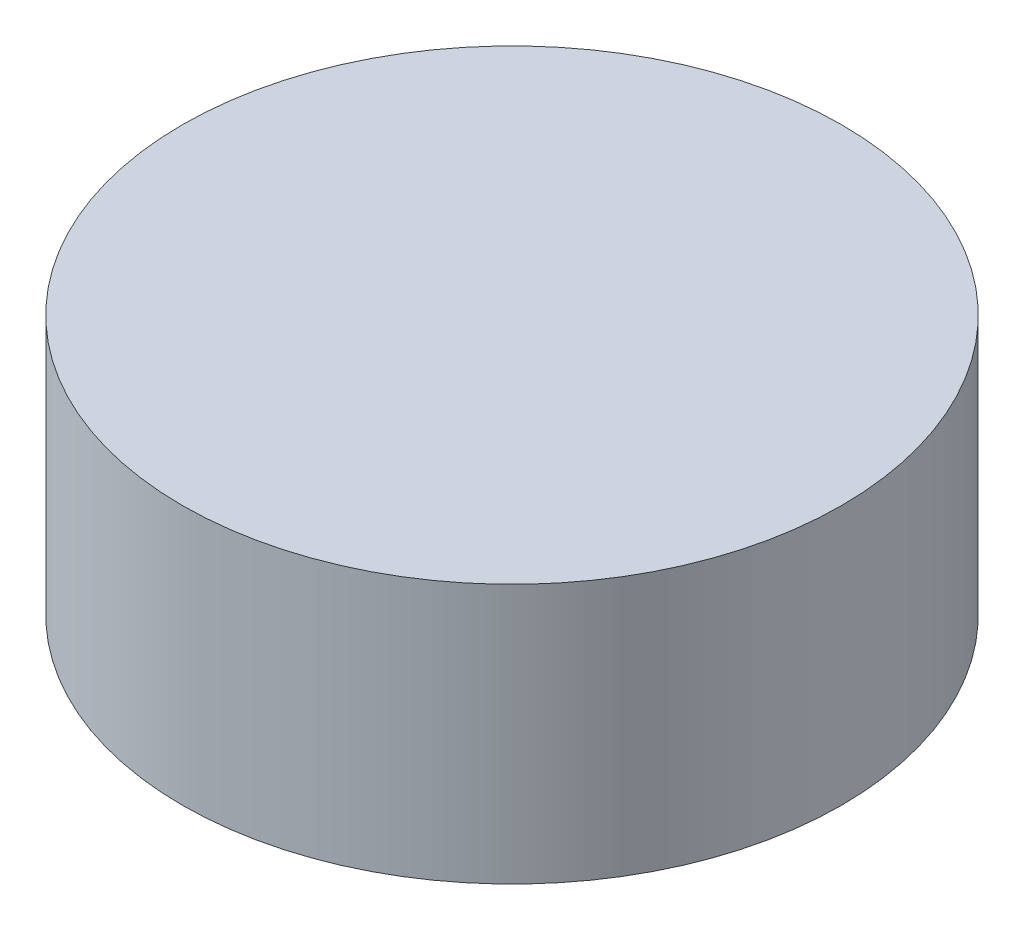
ISO-10303-21;
HEADER;
FILE_DESCRIPTION(('STEP AP214'),'2;1');
FILE_NAME('part.step','',(''),(''),'','','');
FILE_SCHEMA(('AUTOMOTIVE_DESIGN { 1 0 10303 214 1 1 1 1 }'));
ENDSEC;
DATA;
#1=APPLICATION_CONTEXT('core data for automotive mechanical design processes');
#2=APPLICATION_PROTOCOL_DEFINITION('international standard','automotive_design',2000,#1);
#3=PRODUCT_CONTEXT('',#1,'mechanical');
#4=PRODUCT('Part','Part','',(#3));
#5=PRODUCT_RELATED_PRODUCT_CATEGORY('part','',(#4));
#6=PRODUCT_DEFINITION_FORMATION('','',#4);
#7=PRODUCT_DEFINITION_CONTEXT('part definition',#1,'design');
#8=PRODUCT_DEFINITION('design','',#6,#7);
#9=PRODUCT_DEFINITION_SHAPE('','',#8);
#10=(LENGTH_UNIT() NAMED_UNIT(*) SI_UNIT(.MILLI.,.METRE.));
#11=(NAMED_UNIT(*) PLANE_ANGLE_UNIT() SI_UNIT($,.RADIAN.));
#12=(NAMED_UNIT(*) SI_UNIT($,.STERADIAN.) SOLID_ANGLE_UNIT());
#13=UNCERTAINTY_MEASURE_WITH_UNIT(LENGTH_MEASURE(1.E-05),#10,'distance_accuracy_value','');
#14=(GEOMETRIC_REPRESENTATION_CONTEXT(3) GLOBAL_UNCERTAINTY_ASSIGNED_CONTEXT((#13)) GLOBAL_UNIT_ASSIGNED_CONTEXT((#10,
#11,#12)) REPRESENTATION_CONTEXT('',''));
#15=CARTESIAN_POINT('',(0.,0.,0.));
#16=DIRECTION('',(0.,0.,1.));
#17=DIRECTION('',(1.,0.,0.));
#18=AXIS2_PLACEMENT_3D('',#15,#16,#17);
#19=CARTESIAN_POINT('',(0.,10.,0.));
#20=DIRECTION('',(0.,-1.,0.));
#21=DIRECTION('',(0.,0.,-1.));
#22=AXIS2_PLACEMENT_3D('',#19,#20,#21);
#23=CYLINDRICAL_SURFACE('',#22,12.7);
#24=CARTESIAN_POINT('',(0.,10.,0.));
#25=DIRECTION('',(0.,1.,0.));
#26=DIRECTION('',(0.,0.,1.));
#27=AXIS2_PLACEMENT_3D('',#24,#25,#26);
#28=CIRCLE('',#27,12.7);
#29=CARTESIAN_POINT('',(0.,10.,12.7));
#30=VERTEX_POINT('',#29);
#31=EDGE_CURVE('E10',#30,#30,#28,.T.);
#32=ORIENTED_EDGE('',*,*,#31,.F.);
#33=EDGE_LOOP('',(#32));
#34=FACE_BOUND('',#33,.T.);
#35=CARTESIAN_POINT('',(0.,0.,0.));
#36=DIRECTION('',(0.,1.,0.));
#37=DIRECTION('',(0.,0.,1.));
#38=AXIS2_PLACEMENT_3D('',#35,#36,#37);
#39=CIRCLE('',#38,12.7);
#40=CARTESIAN_POINT('',(0.,0.,12.7));
#41=VERTEX_POINT('',#40);
#42=EDGE_CURVE('E40',#41,#41,#39,.T.);
#43=ORIENTED_EDGE('',*,*,#42,.T.);
#44=EDGE_LOOP('',(#43));
#45=FACE_BOUND('',#44,.T.);
#46=ADVANCED_FACE('F37',(#34,#45),#23,.T.);
#47=CARTESIAN_POINT('',(0.,10.,0.));
#48=DIRECTION('',(0.,1.,0.));
#49=DIRECTION('',(0.,0.,1.));
#50=AXIS2_PLACEMENT_3D('',#47,#48,#49);
#51=PLANE('',#50);
#52=ORIENTED_EDGE('',*,*,#31,.T.);
#53=EDGE_LOOP('',(#52));
#54=FACE_BOUND('',#53,.T.);
#55=ADVANCED_FACE('F54',(#54),#51,.T.);
#56=CARTESIAN_POINT('',(0.,0.,0.));
#57=DIRECTION('',(0.,1.,0.));
#58=DIRECTION('',(0.,0.,1.));
#59=AXIS2_PLACEMENT_3D('',#56,#57,#58);
#60=PLANE('',#59);
#61=ORIENTED_EDGE('',*,*,#42,.F.);
#62=EDGE_LOOP('',(#61));
#63=FACE_BOUND('',#62,.T.);
#64=ADVANCED_FACE('F52',(#63),#60,.F.);
#65=CLOSED_SHELL('',(#46,#55,#64));
#66=MANIFOLD_SOLID_BREP('B2',#65);
#67=ADVANCED_BREP_SHAPE_REPRESENTATION('',(#18,#66),#14);
#68=SHAPE_DEFINITION_REPRESENTATION(#9,#67);
ENDSEC;
END-ISO-10303-21;
